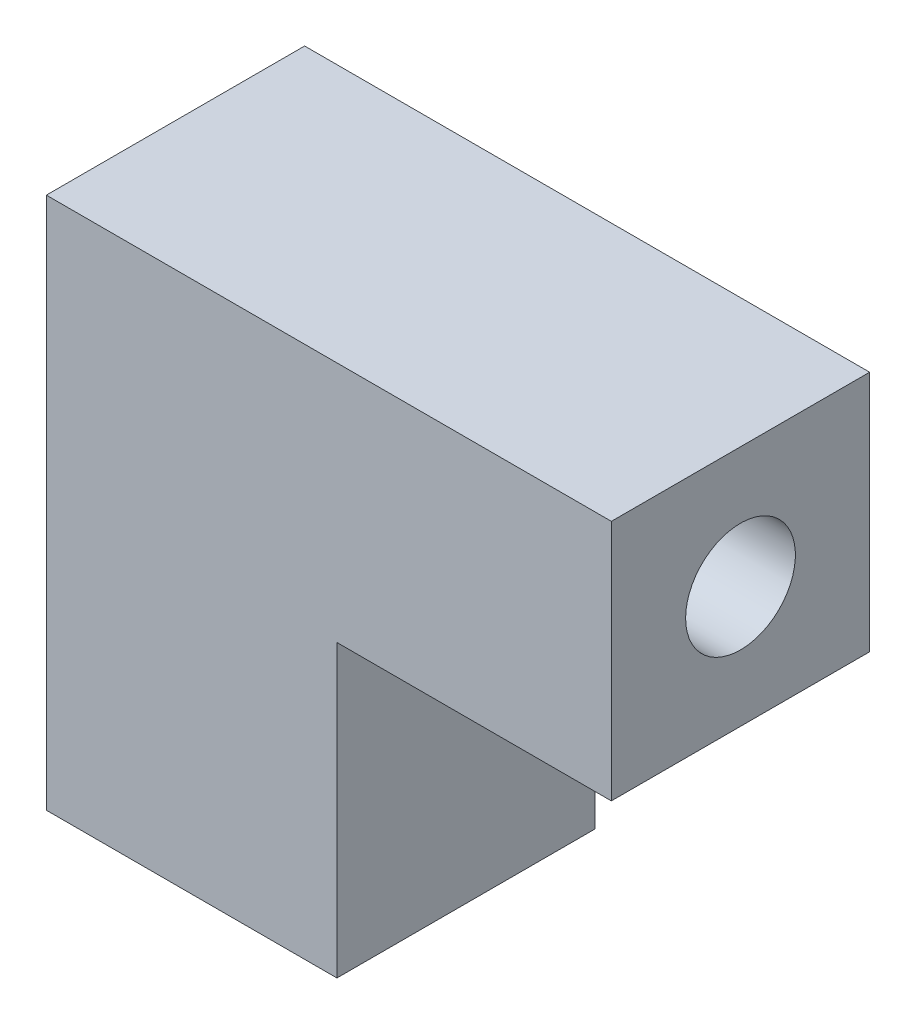
ISO-10303-21;
HEADER;
FILE_DESCRIPTION(('STEP AP214'),'2;1');
FILE_NAME('part.step','',(''),(''),'','','');
FILE_SCHEMA(('AUTOMOTIVE_DESIGN { 1 0 10303 214 1 1 1 1 }'));
ENDSEC;
DATA;
#1=APPLICATION_CONTEXT('core data for automotive mechanical design processes');
#2=APPLICATION_PROTOCOL_DEFINITION('international standard','automotive_design',2000,#1);
#3=PRODUCT_CONTEXT('',#1,'mechanical');
#4=PRODUCT('Part','Part','',(#3));
#5=PRODUCT_RELATED_PRODUCT_CATEGORY('part','',(#4));
#6=PRODUCT_DEFINITION_FORMATION('','',#4);
#7=PRODUCT_DEFINITION_CONTEXT('part definition',#1,'design');
#8=PRODUCT_DEFINITION('design','',#6,#7);
#9=PRODUCT_DEFINITION_SHAPE('','',#8);
#10=(LENGTH_UNIT() NAMED_UNIT(*) SI_UNIT(.MILLI.,.METRE.));
#11=(NAMED_UNIT(*) PLANE_ANGLE_UNIT() SI_UNIT($,.RADIAN.));
#12=(NAMED_UNIT(*) SI_UNIT($,.STERADIAN.) SOLID_ANGLE_UNIT());
#13=UNCERTAINTY_MEASURE_WITH_UNIT(LENGTH_MEASURE(1.E-05),#10,'distance_accuracy_value','');
#14=(GEOMETRIC_REPRESENTATION_CONTEXT(3) GLOBAL_UNCERTAINTY_ASSIGNED_CONTEXT((#13)) GLOBAL_UNIT_ASSIGNED_CONTEXT((#10,
#11,#12)) REPRESENTATION_CONTEXT('',''));
#15=CARTESIAN_POINT('',(0.,0.,0.));
#16=DIRECTION('',(0.,0.,1.));
#17=DIRECTION('',(1.,0.,0.));
#18=AXIS2_PLACEMENT_3D('',#15,#16,#17);
#19=CARTESIAN_POINT('',(0.,0.,8.));
#20=DIRECTION('',(1.,0.,0.));
#21=DIRECTION('',(0.,0.,-1.));
#22=AXIS2_PLACEMENT_3D('',#19,#20,#21);
#23=PLANE('',#22);
#24=DIRECTION('',(0.,-1.,0.));
#25=VECTOR('',#24,1.);
#26=CARTESIAN_POINT('',(0.,0.,-8.));
#27=LINE('',#26,#25);
#28=CARTESIAN_POINT('',(0.,33.,-8.));
#29=VERTEX_POINT('',#28);
#30=CARTESIAN_POINT('',(0.,0.,-8.));
#31=VERTEX_POINT('',#30);
#32=EDGE_CURVE('E83',#29,#31,#27,.T.);
#33=ORIENTED_EDGE('',*,*,#32,.T.);
#34=DIRECTION('',(0.,0.,-1.));
#35=VECTOR('',#34,1.);
#36=CARTESIAN_POINT('',(0.,0.,8.));
#37=LINE('',#36,#35);
#38=CARTESIAN_POINT('',(0.,0.,8.));
#39=VERTEX_POINT('',#38);
#40=EDGE_CURVE('E118',#39,#31,#37,.T.);
#41=ORIENTED_EDGE('',*,*,#40,.F.);
#42=DIRECTION('',(0.,-1.,0.));
#43=VECTOR('',#42,1.);
#44=CARTESIAN_POINT('',(0.,0.,8.));
#45=LINE('',#44,#43);
#46=CARTESIAN_POINT('',(0.,33.,8.));
#47=VERTEX_POINT('',#46);
#48=EDGE_CURVE('E54',#47,#39,#45,.T.);
#49=ORIENTED_EDGE('',*,*,#48,.F.);
#50=DIRECTION('',(0.,0.,-1.));
#51=VECTOR('',#50,1.);
#52=CARTESIAN_POINT('',(0.,33.,8.));
#53=LINE('',#52,#51);
#54=EDGE_CURVE('E114',#47,#29,#53,.T.);
#55=ORIENTED_EDGE('',*,*,#54,.T.);
#56=EDGE_LOOP('',(#33,#41,#49,#55));
#57=FACE_BOUND('',#56,.T.);
#58=CARTESIAN_POINT('',(0.,25.5,0.));
#59=DIRECTION('',(-1.,0.,0.));
#60=DIRECTION('',(0.,0.,1.));
#61=AXIS2_PLACEMENT_3D('',#58,#59,#60);
#62=CIRCLE('',#61,3.4);
#63=CARTESIAN_POINT('',(0.,25.5,3.4));
#64=VERTEX_POINT('',#63);
#65=EDGE_CURVE('E151',#64,#64,#62,.T.);
#66=ORIENTED_EDGE('',*,*,#65,.F.);
#67=EDGE_LOOP('',(#66));
#68=FACE_BOUND('',#67,.T.);
#69=ADVANCED_FACE('F37',(#57,#68),#23,.F.);
#70=CARTESIAN_POINT('',(18.,0.,8.));
#71=DIRECTION('',(0.,1.,0.));
#72=DIRECTION('',(-1.,0.,0.));
#73=AXIS2_PLACEMENT_3D('',#70,#71,#72);
#74=PLANE('',#73);
#75=DIRECTION('',(1.,0.,0.));
#76=VECTOR('',#75,1.);
#77=CARTESIAN_POINT('',(18.,0.,-8.));
#78=LINE('',#77,#76);
#79=CARTESIAN_POINT('',(18.,0.,-8.));
#80=VERTEX_POINT('',#79);
#81=EDGE_CURVE('E122',#31,#80,#78,.T.);
#82=ORIENTED_EDGE('',*,*,#81,.T.);
#83=DIRECTION('',(0.,0.,-1.));
#84=VECTOR('',#83,1.);
#85=CARTESIAN_POINT('',(18.,0.,8.));
#86=LINE('',#85,#84);
#87=CARTESIAN_POINT('',(18.,0.,8.));
#88=VERTEX_POINT('',#87);
#89=EDGE_CURVE('E11',#88,#80,#86,.T.);
#90=ORIENTED_EDGE('',*,*,#89,.F.);
#91=DIRECTION('',(1.,0.,0.));
#92=VECTOR('',#91,1.);
#93=CARTESIAN_POINT('',(18.,0.,8.));
#94=LINE('',#93,#92);
#95=EDGE_CURVE('E133',#39,#88,#94,.T.);
#96=ORIENTED_EDGE('',*,*,#95,.F.);
#97=ORIENTED_EDGE('',*,*,#40,.T.);
#98=EDGE_LOOP('',(#82,#90,#96,#97));
#99=FACE_BOUND('',#98,.T.);
#100=ADVANCED_FACE('F39',(#99),#74,.F.);
#101=CARTESIAN_POINT('',(18.,18.0000000000004,8.));
#102=DIRECTION('',(-1.,0.,0.));
#103=DIRECTION('',(0.,-1.,0.));
#104=AXIS2_PLACEMENT_3D('',#101,#102,#103);
#105=PLANE('',#104);
#106=DIRECTION('',(0.,1.,0.));
#107=VECTOR('',#106,1.);
#108=CARTESIAN_POINT('',(18.,18.0000000000004,-8.));
#109=LINE('',#108,#107);
#110=CARTESIAN_POINT('',(18.,18.0000000000004,-8.));
#111=VERTEX_POINT('',#110);
#112=EDGE_CURVE('E125',#80,#111,#109,.T.);
#113=ORIENTED_EDGE('',*,*,#112,.T.);
#114=DIRECTION('',(0.,0.,-1.));
#115=VECTOR('',#114,1.);
#116=CARTESIAN_POINT('',(18.,18.0000000000004,8.));
#117=LINE('',#116,#115);
#118=CARTESIAN_POINT('',(18.,18.0000000000004,8.));
#119=VERTEX_POINT('',#118);
#120=EDGE_CURVE('E46',#119,#111,#117,.T.);
#121=ORIENTED_EDGE('',*,*,#120,.F.);
#122=DIRECTION('',(0.,1.,0.));
#123=VECTOR('',#122,1.);
#124=CARTESIAN_POINT('',(18.,18.0000000000004,8.));
#125=LINE('',#124,#123);
#126=EDGE_CURVE('E91',#88,#119,#125,.T.);
#127=ORIENTED_EDGE('',*,*,#126,.F.);
#128=ORIENTED_EDGE('',*,*,#89,.T.);
#129=EDGE_LOOP('',(#113,#121,#127,#128));
#130=FACE_BOUND('',#129,.T.);
#131=ADVANCED_FACE('F176',(#130),#105,.F.);
#132=CARTESIAN_POINT('',(35.,18.0000000000004,8.));
#133=DIRECTION('',(0.,1.,0.));
#134=DIRECTION('',(-1.,0.,0.));
#135=AXIS2_PLACEMENT_3D('',#132,#133,#134);
#136=PLANE('',#135);
#137=DIRECTION('',(1.,0.,0.));
#138=VECTOR('',#137,1.);
#139=CARTESIAN_POINT('',(35.,18.0000000000004,-8.));
#140=LINE('',#139,#138);
#141=CARTESIAN_POINT('',(35.,18.0000000000004,-8.));
#142=VERTEX_POINT('',#141);
#143=EDGE_CURVE('E128',#111,#142,#140,.T.);
#144=ORIENTED_EDGE('',*,*,#143,.T.);
#145=DIRECTION('',(0.,0.,-1.));
#146=VECTOR('',#145,1.);
#147=CARTESIAN_POINT('',(35.,18.0000000000004,8.));
#148=LINE('',#147,#146);
#149=CARTESIAN_POINT('',(35.,18.0000000000004,8.));
#150=VERTEX_POINT('',#149);
#151=EDGE_CURVE('E113',#150,#142,#148,.T.);
#152=ORIENTED_EDGE('',*,*,#151,.F.);
#153=DIRECTION('',(1.,0.,0.));
#154=VECTOR('',#153,1.);
#155=CARTESIAN_POINT('',(35.,18.0000000000004,8.));
#156=LINE('',#155,#154);
#157=EDGE_CURVE('E104',#119,#150,#156,.T.);
#158=ORIENTED_EDGE('',*,*,#157,.F.);
#159=ORIENTED_EDGE('',*,*,#120,.T.);
#160=EDGE_LOOP('',(#144,#152,#158,#159));
#161=FACE_BOUND('',#160,.T.);
#162=ADVANCED_FACE('F139',(#161),#136,.F.);
#163=CARTESIAN_POINT('',(35.,33.0000000000004,8.));
#164=DIRECTION('',(-1.,0.,0.));
#165=DIRECTION('',(0.,0.,1.));
#166=AXIS2_PLACEMENT_3D('',#163,#164,#165);
#167=PLANE('',#166);
#168=CARTESIAN_POINT('',(35.,25.5,0.));
#169=DIRECTION('',(-1.,0.,0.));
#170=DIRECTION('',(0.,0.,1.));
#171=AXIS2_PLACEMENT_3D('',#168,#169,#170);
#172=CIRCLE('',#171,3.4);
#173=CARTESIAN_POINT('',(35.,25.5,3.4));
#174=VERTEX_POINT('',#173);
#175=EDGE_CURVE('E126',#174,#174,#172,.T.);
#176=ORIENTED_EDGE('',*,*,#175,.T.);
#177=EDGE_LOOP('',(#176));
#178=FACE_BOUND('',#177,.T.);
#179=DIRECTION('',(0.,1.,0.));
#180=VECTOR('',#179,1.);
#181=CARTESIAN_POINT('',(35.,33.0000000000004,-8.));
#182=LINE('',#181,#180);
#183=CARTESIAN_POINT('',(35.,33.0000000000004,-8.));
#184=VERTEX_POINT('',#183);
#185=EDGE_CURVE('E112',#142,#184,#182,.T.);
#186=ORIENTED_EDGE('',*,*,#185,.T.);
#187=DIRECTION('',(0.,0.,-1.));
#188=VECTOR('',#187,1.);
#189=CARTESIAN_POINT('',(35.,33.0000000000004,8.));
#190=LINE('',#189,#188);
#191=CARTESIAN_POINT('',(35.,33.0000000000004,8.));
#192=VERTEX_POINT('',#191);
#193=EDGE_CURVE('E109',#192,#184,#190,.T.);
#194=ORIENTED_EDGE('',*,*,#193,.F.);
#195=DIRECTION('',(0.,1.,0.));
#196=VECTOR('',#195,1.);
#197=CARTESIAN_POINT('',(35.,33.0000000000004,8.));
#198=LINE('',#197,#196);
#199=EDGE_CURVE('E98',#150,#192,#198,.T.);
#200=ORIENTED_EDGE('',*,*,#199,.F.);
#201=ORIENTED_EDGE('',*,*,#151,.T.);
#202=EDGE_LOOP('',(#186,#194,#200,#201));
#203=FACE_BOUND('',#202,.T.);
#204=ADVANCED_FACE('F110',(#178,#203),#167,.F.);
#205=CARTESIAN_POINT('',(0.,33.,8.));
#206=DIRECTION('',(0.,-1.,0.));
#207=DIRECTION('',(1.,0.,0.));
#208=AXIS2_PLACEMENT_3D('',#205,#206,#207);
#209=PLANE('',#208);
#210=DIRECTION('',(-1.,0.,0.));
#211=VECTOR('',#210,1.);
#212=CARTESIAN_POINT('',(0.,33.,-8.));
#213=LINE('',#212,#211);
#214=EDGE_CURVE('E77',#184,#29,#213,.T.);
#215=ORIENTED_EDGE('',*,*,#214,.T.);
#216=ORIENTED_EDGE('',*,*,#54,.F.);
#217=DIRECTION('',(-1.,0.,0.));
#218=VECTOR('',#217,1.);
#219=CARTESIAN_POINT('',(0.,33.,8.));
#220=LINE('',#219,#218);
#221=EDGE_CURVE('E102',#192,#47,#220,.T.);
#222=ORIENTED_EDGE('',*,*,#221,.F.);
#223=ORIENTED_EDGE('',*,*,#193,.T.);
#224=EDGE_LOOP('',(#215,#216,#222,#223));
#225=FACE_BOUND('',#224,.T.);
#226=ADVANCED_FACE('F116',(#225),#209,.F.);
#227=CARTESIAN_POINT('',(0.,0.,8.));
#228=DIRECTION('',(0.,0.,-1.));
#229=DIRECTION('',(-1.,0.,0.));
#230=AXIS2_PLACEMENT_3D('',#227,#228,#229);
#231=PLANE('',#230);
#232=ORIENTED_EDGE('',*,*,#95,.T.);
#233=ORIENTED_EDGE('',*,*,#126,.T.);
#234=ORIENTED_EDGE('',*,*,#157,.T.);
#235=ORIENTED_EDGE('',*,*,#199,.T.);
#236=ORIENTED_EDGE('',*,*,#221,.T.);
#237=ORIENTED_EDGE('',*,*,#48,.T.);
#238=EDGE_LOOP('',(#232,#233,#234,#235,#236,#237));
#239=FACE_BOUND('',#238,.T.);
#240=ADVANCED_FACE('F100',(#239),#231,.F.);
#241=CARTESIAN_POINT('',(0.,0.,-8.));
#242=DIRECTION('',(0.,0.,-1.));
#243=DIRECTION('',(-1.,0.,0.));
#244=AXIS2_PLACEMENT_3D('',#241,#242,#243);
#245=PLANE('',#244);
#246=ORIENTED_EDGE('',*,*,#81,.F.);
#247=ORIENTED_EDGE('',*,*,#32,.F.);
#248=ORIENTED_EDGE('',*,*,#214,.F.);
#249=ORIENTED_EDGE('',*,*,#185,.F.);
#250=ORIENTED_EDGE('',*,*,#143,.F.);
#251=ORIENTED_EDGE('',*,*,#112,.F.);
#252=EDGE_LOOP('',(#246,#247,#248,#249,#250,#251));
#253=FACE_BOUND('',#252,.T.);
#254=ADVANCED_FACE('F142',(#253),#245,.T.);
#255=CARTESIAN_POINT('',(0.,25.5,0.));
#256=DIRECTION('',(-1.,0.,0.));
#257=DIRECTION('',(0.,0.,1.));
#258=AXIS2_PLACEMENT_3D('',#255,#256,#257);
#259=CYLINDRICAL_SURFACE('',#258,3.4);
#260=ORIENTED_EDGE('',*,*,#175,.F.);
#261=EDGE_LOOP('',(#260));
#262=FACE_BOUND('',#261,.T.);
#263=ORIENTED_EDGE('',*,*,#65,.T.);
#264=EDGE_LOOP('',(#263));
#265=FACE_BOUND('',#264,.T.);
#266=ADVANCED_FACE('F161',(#262,#265),#259,.F.);
#267=CLOSED_SHELL('',(#69,#100,#131,#162,#204,#226,#240,#254,#266));
#268=MANIFOLD_SOLID_BREP('B2',#267);
#269=ADVANCED_BREP_SHAPE_REPRESENTATION('',(#18,#268),#14);
#270=SHAPE_DEFINITION_REPRESENTATION(#9,#269);
ENDSEC;
END-ISO-10303-21;
